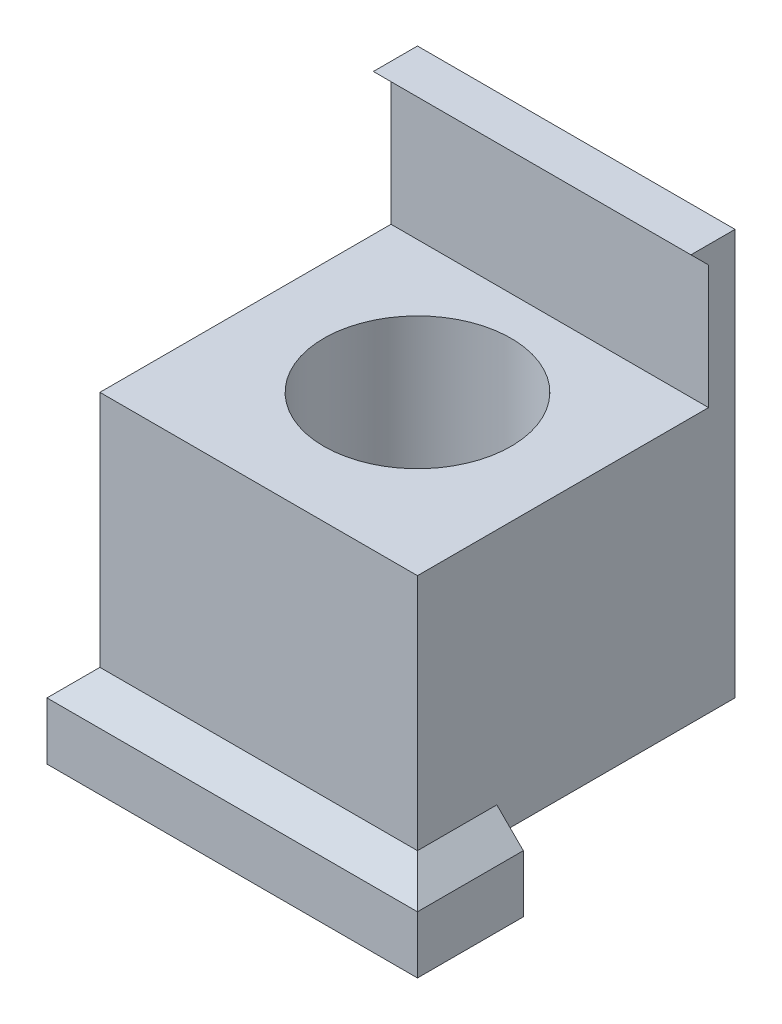
ISO-10303-21;
HEADER;
FILE_DESCRIPTION(('STEP AP214'),'2;1');
FILE_NAME('part.step','',(''),(''),'','','');
FILE_SCHEMA(('AUTOMOTIVE_DESIGN { 1 0 10303 214 1 1 1 1 }'));
ENDSEC;
DATA;
#1=APPLICATION_CONTEXT('core data for automotive mechanical design processes');
#2=APPLICATION_PROTOCOL_DEFINITION('international standard','automotive_design',2000,#1);
#3=PRODUCT_CONTEXT('',#1,'mechanical');
#4=PRODUCT('Part','Part','',(#3));
#5=PRODUCT_RELATED_PRODUCT_CATEGORY('part','',(#4));
#6=PRODUCT_DEFINITION_FORMATION('','',#4);
#7=PRODUCT_DEFINITION_CONTEXT('part definition',#1,'design');
#8=PRODUCT_DEFINITION('design','',#6,#7);
#9=PRODUCT_DEFINITION_SHAPE('','',#8);
#10=(LENGTH_UNIT() NAMED_UNIT(*) SI_UNIT(.MILLI.,.METRE.));
#11=(NAMED_UNIT(*) PLANE_ANGLE_UNIT() SI_UNIT($,.RADIAN.));
#12=(NAMED_UNIT(*) SI_UNIT($,.STERADIAN.) SOLID_ANGLE_UNIT());
#13=UNCERTAINTY_MEASURE_WITH_UNIT(LENGTH_MEASURE(1.E-05),#10,'distance_accuracy_value','');
#14=(GEOMETRIC_REPRESENTATION_CONTEXT(3) GLOBAL_UNCERTAINTY_ASSIGNED_CONTEXT((#13)) GLOBAL_UNIT_ASSIGNED_CONTEXT((#10,
#11,#12)) REPRESENTATION_CONTEXT('',''));
#15=CARTESIAN_POINT('',(0.,0.,0.));
#16=DIRECTION('',(0.,0.,1.));
#17=DIRECTION('',(1.,0.,0.));
#18=AXIS2_PLACEMENT_3D('',#15,#16,#17);
#19=CARTESIAN_POINT('',(0.,0.,3.96777206283517));
#20=DIRECTION('',(0.,0.,-1.));
#21=DIRECTION('',(-1.,0.,0.));
#22=AXIS2_PLACEMENT_3D('',#19,#20,#21);
#23=PLANE('',#22);
#24=DIRECTION('',(1.,0.,0.));
#25=VECTOR('',#24,1.);
#26=CARTESIAN_POINT('',(-14.7575768232034,-1.625,3.96777206283517));
#27=LINE('',#26,#25);
#28=CARTESIAN_POINT('',(-13.2575768232034,-1.625,3.96777206283517));
#29=VERTEX_POINT('',#28);
#30=CARTESIAN_POINT('',(1.74242317679656,-1.625,3.96777206283517));
#31=VERTEX_POINT('',#30);
#32=EDGE_CURVE('E53',#29,#31,#27,.T.);
#33=ORIENTED_EDGE('',*,*,#32,.T.);
#34=DIRECTION('',(0.,1.,0.));
#35=VECTOR('',#34,1.);
#36=CARTESIAN_POINT('',(1.74242317679656,-3.25,3.96777206283517));
#37=LINE('',#36,#35);
#38=CARTESIAN_POINT('',(1.74242317679656,-3.25,3.96777206283517));
#39=VERTEX_POINT('',#38);
#40=EDGE_CURVE('E48',#39,#31,#37,.T.);
#41=ORIENTED_EDGE('',*,*,#40,.F.);
#42=DIRECTION('',(-1.,0.,0.));
#43=VECTOR('',#42,1.);
#44=CARTESIAN_POINT('',(-14.7575768232034,-3.25,3.96777206283517));
#45=LINE('',#44,#43);
#46=CARTESIAN_POINT('',(-13.2575768232034,-3.25,3.96777206283517));
#47=VERTEX_POINT('',#46);
#48=EDGE_CURVE('E223',#39,#47,#45,.T.);
#49=ORIENTED_EDGE('',*,*,#48,.T.);
#50=DIRECTION('',(0.,-1.,0.));
#51=VECTOR('',#50,1.);
#52=CARTESIAN_POINT('',(-13.2575768232034,0.,3.96777206283517));
#53=LINE('',#52,#51);
#54=EDGE_CURVE('E199',#29,#47,#53,.T.);
#55=ORIENTED_EDGE('',*,*,#54,.F.);
#56=EDGE_LOOP('',(#33,#41,#49,#55));
#57=FACE_BOUND('',#56,.T.);
#58=ADVANCED_FACE('F33',(#57),#23,.T.);
#59=CARTESIAN_POINT('',(3.24242317679656,-3.25,0.967772062835173));
#60=DIRECTION('',(1.,0.,0.));
#61=DIRECTION('',(0.,0.,-1.));
#62=AXIS2_PLACEMENT_3D('',#59,#60,#61);
#63=PLANE('',#62);
#64=DIRECTION('',(0.,1.,0.));
#65=VECTOR('',#64,1.);
#66=CARTESIAN_POINT('',(3.24242317679656,-3.25,0.967772062835173));
#67=LINE('',#66,#65);
#68=CARTESIAN_POINT('',(3.24242317679656,-1.625,0.967772062835173));
#69=VERTEX_POINT('',#68);
#70=CARTESIAN_POINT('',(3.24242317679656,0.,0.967772062835173));
#71=VERTEX_POINT('',#70);
#72=EDGE_CURVE('E348',#69,#71,#67,.T.);
#73=ORIENTED_EDGE('',*,*,#72,.F.);
#74=DIRECTION('',(0.,0.,1.));
#75=VECTOR('',#74,1.);
#76=CARTESIAN_POINT('',(3.24242317679656,-1.625,3.96777206283517));
#77=LINE('',#76,#75);
#78=CARTESIAN_POINT('',(3.24242317679656,-1.625,5.46777206283517));
#79=VERTEX_POINT('',#78);
#80=EDGE_CURVE('E262',#69,#79,#77,.T.);
#81=ORIENTED_EDGE('',*,*,#80,.T.);
#82=DIRECTION('',(0.,1.,0.));
#83=VECTOR('',#82,1.);
#84=CARTESIAN_POINT('',(3.24242317679656,-3.25,5.46777206283517));
#85=LINE('',#84,#83);
#86=CARTESIAN_POINT('',(3.24242317679656,0.,5.46777206283517));
#87=VERTEX_POINT('',#86);
#88=EDGE_CURVE('E269',#79,#87,#85,.T.);
#89=ORIENTED_EDGE('',*,*,#88,.T.);
#90=DIRECTION('',(0.,0.,-1.));
#91=VECTOR('',#90,1.);
#92=CARTESIAN_POINT('',(3.24242317679656,0.,0.967772062835173));
#93=LINE('',#92,#91);
#94=EDGE_CURVE('E354',#87,#71,#93,.T.);
#95=ORIENTED_EDGE('',*,*,#94,.T.);
#96=EDGE_LOOP('',(#73,#81,#89,#95));
#97=FACE_BOUND('',#96,.T.);
#98=ADVANCED_FACE('F418',(#97),#63,.F.);
#99=CARTESIAN_POINT('',(0.,0.,0.));
#100=DIRECTION('',(0.,1.,0.));
#101=DIRECTION('',(0.,0.,1.));
#102=AXIS2_PLACEMENT_3D('',#99,#100,#101);
#103=PLANE('',#102);
#104=ORIENTED_EDGE('',*,*,#94,.F.);
#105=DIRECTION('',(1.,0.,0.));
#106=VECTOR('',#105,1.);
#107=CARTESIAN_POINT('',(3.24242317679656,0.,5.46777206283517));
#108=LINE('',#107,#106);
#109=CARTESIAN_POINT('',(-14.7575768232034,0.,5.46777206283517));
#110=VERTEX_POINT('',#109);
#111=EDGE_CURVE('E266',#110,#87,#108,.T.);
#112=ORIENTED_EDGE('',*,*,#111,.F.);
#113=DIRECTION('',(0.,0.,1.));
#114=VECTOR('',#113,1.);
#115=CARTESIAN_POINT('',(-14.7575768232034,0.,6.96777206283517));
#116=LINE('',#115,#114);
#117=CARTESIAN_POINT('',(-14.7575768232034,0.,-12.5322279371648));
#118=VERTEX_POINT('',#117);
#119=EDGE_CURVE('E246',#118,#110,#116,.T.);
#120=ORIENTED_EDGE('',*,*,#119,.F.);
#121=DIRECTION('',(-1.,0.,0.));
#122=VECTOR('',#121,1.);
#123=CARTESIAN_POINT('',(-14.7575768232034,0.,-12.5322279371648));
#124=LINE('',#123,#122);
#125=CARTESIAN_POINT('',(3.24242317679655,0.,-12.5322279371648));
#126=VERTEX_POINT('',#125);
#127=EDGE_CURVE('E307',#126,#118,#124,.T.);
#128=ORIENTED_EDGE('',*,*,#127,.F.);
#129=DIRECTION('',(0.,0.,-1.));
#130=VECTOR('',#129,1.);
#131=CARTESIAN_POINT('',(3.24242317679655,0.,-12.5322279371648));
#132=LINE('',#131,#130);
#133=EDGE_CURVE('E302',#71,#126,#132,.T.);
#134=ORIENTED_EDGE('',*,*,#133,.F.);
#135=EDGE_LOOP('',(#104,#112,#120,#128,#134));
#136=FACE_BOUND('',#135,.T.);
#137=ADVANCED_FACE('F333',(#136),#103,.F.);
#138=CARTESIAN_POINT('',(3.24242317679655,15.,-12.5322279371648));
#139=DIRECTION('',(-1.,0.,0.));
#140=DIRECTION('',(0.,0.,1.));
#141=AXIS2_PLACEMENT_3D('',#138,#139,#140);
#142=PLANE('',#141);
#143=ORIENTED_EDGE('',*,*,#133,.T.);
#144=DIRECTION('',(0.,-1.,0.));
#145=VECTOR('',#144,1.);
#146=CARTESIAN_POINT('',(3.24242317679655,15.,-12.5322279371648));
#147=LINE('',#146,#145);
#148=CARTESIAN_POINT('',(3.24242317679655,23.,-12.5322279371648));
#149=VERTEX_POINT('',#148);
#150=EDGE_CURVE('E206',#149,#126,#147,.T.);
#151=ORIENTED_EDGE('',*,*,#150,.F.);
#152=DIRECTION('',(0.,0.,-1.));
#153=VECTOR('',#152,1.);
#154=CARTESIAN_POINT('',(3.24242317679655,23.,-12.5322279371648));
#155=LINE('',#154,#153);
#156=CARTESIAN_POINT('',(3.24242317679656,23.,-10.0322279371648));
#157=VERTEX_POINT('',#156);
#158=EDGE_CURVE('E286',#157,#149,#155,.T.);
#159=ORIENTED_EDGE('',*,*,#158,.F.);
#160=DIRECTION('',(0.,-0.706137307692291,-0.708074927310014));
#161=VECTOR('',#160,1.);
#162=CARTESIAN_POINT('',(3.24242317679655,22.0027364612741,-11.0322279371648));
#163=LINE('',#162,#161);
#164=CARTESIAN_POINT('',(3.24242317679655,22.0027364612741,-11.0322279371648));
#165=VERTEX_POINT('',#164);
#166=EDGE_CURVE('E274',#157,#165,#163,.T.);
#167=ORIENTED_EDGE('',*,*,#166,.T.);
#168=DIRECTION('',(0.,-1.,0.));
#169=VECTOR('',#168,1.);
#170=CARTESIAN_POINT('',(3.24242317679656,23.,-11.0322279371648));
#171=LINE('',#170,#169);
#172=CARTESIAN_POINT('',(3.24242317679656,15.,-11.0322279371648));
#173=VERTEX_POINT('',#172);
#174=EDGE_CURVE('E292',#165,#173,#171,.T.);
#175=ORIENTED_EDGE('',*,*,#174,.T.);
#176=DIRECTION('',(0.,0.,-1.));
#177=VECTOR('',#176,1.);
#178=CARTESIAN_POINT('',(3.24242317679655,15.,-12.5322279371648));
#179=LINE('',#178,#177);
#180=CARTESIAN_POINT('',(3.24242317679656,15.,5.46777206283517));
#181=VERTEX_POINT('',#180);
#182=EDGE_CURVE('E309',#181,#173,#179,.T.);
#183=ORIENTED_EDGE('',*,*,#182,.F.);
#184=DIRECTION('',(0.,-1.,0.));
#185=VECTOR('',#184,1.);
#186=CARTESIAN_POINT('',(3.24242317679656,15.,5.46777206283517));
#187=LINE('',#186,#185);
#188=CARTESIAN_POINT('',(3.24242317679655,1.5,5.46777206283517));
#189=VERTEX_POINT('',#188);
#190=EDGE_CURVE('E204',#181,#189,#187,.T.);
#191=ORIENTED_EDGE('',*,*,#190,.T.);
#192=DIRECTION('',(0.,0.,1.));
#193=VECTOR('',#192,1.);
#194=CARTESIAN_POINT('',(3.24242317679656,1.5,0.967772062835173));
#195=LINE('',#194,#193);
#196=CARTESIAN_POINT('',(3.24242317679655,1.5,0.967772062835173));
#197=VERTEX_POINT('',#196);
#198=EDGE_CURVE('E344',#197,#189,#195,.T.);
#199=ORIENTED_EDGE('',*,*,#198,.F.);
#200=DIRECTION('',(0.,1.,0.));
#201=VECTOR('',#200,1.);
#202=CARTESIAN_POINT('',(3.24242317679656,1.5,0.967772062835173));
#203=LINE('',#202,#201);
#204=EDGE_CURVE('E329',#71,#197,#203,.T.);
#205=ORIENTED_EDGE('',*,*,#204,.F.);
#206=EDGE_LOOP('',(#143,#151,#159,#167,#175,#183,#191,#199,#205));
#207=FACE_BOUND('',#206,.T.);
#208=ADVANCED_FACE('F326',(#207),#142,.F.);
#209=CARTESIAN_POINT('',(3.24242317679656,-3.25,5.46777206283517));
#210=DIRECTION('',(0.,0.,1.));
#211=DIRECTION('',(1.,0.,0.));
#212=AXIS2_PLACEMENT_3D('',#209,#210,#211);
#213=PLANE('',#212);
#214=DIRECTION('',(1.,0.,0.));
#215=VECTOR('',#214,1.);
#216=CARTESIAN_POINT('',(3.24242317679656,-1.49347054544951,5.46777206283517));
#217=LINE('',#216,#215);
#218=CARTESIAN_POINT('',(-14.7575768232034,-1.49347054544951,5.46777206283517));
#219=VERTEX_POINT('',#218);
#220=CARTESIAN_POINT('',(-13.2575768232034,-1.49347054544951,5.46777206283517));
#221=VERTEX_POINT('',#220);
#222=EDGE_CURVE('E231',#219,#221,#217,.T.);
#223=ORIENTED_EDGE('',*,*,#222,.F.);
#224=DIRECTION('',(0.,1.,0.));
#225=VECTOR('',#224,1.);
#226=CARTESIAN_POINT('',(-14.7575768232034,-3.25,5.46777206283517));
#227=LINE('',#226,#225);
#228=EDGE_CURVE('E190',#219,#110,#227,.T.);
#229=ORIENTED_EDGE('',*,*,#228,.T.);
#230=ORIENTED_EDGE('',*,*,#111,.T.);
#231=ORIENTED_EDGE('',*,*,#88,.F.);
#232=DIRECTION('',(1.,0.,0.));
#233=VECTOR('',#232,1.);
#234=CARTESIAN_POINT('',(-14.7575768232034,-1.625,5.46777206283517));
#235=LINE('',#234,#233);
#236=CARTESIAN_POINT('',(-13.2575768232034,-1.625,5.46777206283517));
#237=VERTEX_POINT('',#236);
#238=EDGE_CURVE('E258',#237,#79,#235,.T.);
#239=ORIENTED_EDGE('',*,*,#238,.F.);
#240=DIRECTION('',(0.,1.,0.));
#241=VECTOR('',#240,1.);
#242=CARTESIAN_POINT('',(-13.2575768232034,-3.25,5.46777206283517));
#243=LINE('',#242,#241);
#244=EDGE_CURVE('E243',#237,#221,#243,.T.);
#245=ORIENTED_EDGE('',*,*,#244,.T.);
#246=EDGE_LOOP('',(#223,#229,#230,#231,#239,#245));
#247=FACE_BOUND('',#246,.T.);
#248=ADVANCED_FACE('F435',(#247),#213,.F.);
#249=CARTESIAN_POINT('',(-14.7575768232034,-3.25,6.96777206283517));
#250=DIRECTION('',(-1.,0.,0.));
#251=DIRECTION('',(0.,0.,1.));
#252=AXIS2_PLACEMENT_3D('',#249,#250,#251);
#253=PLANE('',#252);
#254=DIRECTION('',(0.,0.,1.));
#255=VECTOR('',#254,1.);
#256=CARTESIAN_POINT('',(-14.7575768232034,-1.49347054544951,-12.5322279371648));
#257=LINE('',#256,#255);
#258=CARTESIAN_POINT('',(-14.7575768232034,-1.49347054544951,-12.5322279371648));
#259=VERTEX_POINT('',#258);
#260=EDGE_CURVE('E238',#259,#219,#257,.T.);
#261=ORIENTED_EDGE('',*,*,#260,.F.);
#262=DIRECTION('',(0.,1.,0.));
#263=VECTOR('',#262,1.);
#264=CARTESIAN_POINT('',(-14.7575768232034,-3.25,-12.5322279371648));
#265=LINE('',#264,#263);
#266=EDGE_CURVE('E250',#259,#118,#265,.T.);
#267=ORIENTED_EDGE('',*,*,#266,.T.);
#268=ORIENTED_EDGE('',*,*,#119,.T.);
#269=ORIENTED_EDGE('',*,*,#228,.F.);
#270=EDGE_LOOP('',(#261,#267,#268,#269));
#271=FACE_BOUND('',#270,.T.);
#272=ADVANCED_FACE('F338',(#271),#253,.F.);
#273=CARTESIAN_POINT('',(-14.7575768232034,15.,-12.5322279371648));
#274=DIRECTION('',(1.,0.,0.));
#275=DIRECTION('',(0.,0.,-1.));
#276=AXIS2_PLACEMENT_3D('',#273,#274,#275);
#277=PLANE('',#276);
#278=DIRECTION('',(0.,0.,-1.));
#279=VECTOR('',#278,1.);
#280=CARTESIAN_POINT('',(-14.7575768232034,1.5,6.96777206283517));
#281=LINE('',#280,#279);
#282=CARTESIAN_POINT('',(-14.7575768232034,1.5,5.46777206283517));
#283=VERTEX_POINT('',#282);
#284=CARTESIAN_POINT('',(-14.7575768232034,1.5,-12.5322279371648));
#285=VERTEX_POINT('',#284);
#286=EDGE_CURVE('E173',#283,#285,#281,.T.);
#287=ORIENTED_EDGE('',*,*,#286,.F.);
#288=DIRECTION('',(0.,-1.,0.));
#289=VECTOR('',#288,1.);
#290=CARTESIAN_POINT('',(-14.7575768232034,15.,5.46777206283517));
#291=LINE('',#290,#289);
#292=CARTESIAN_POINT('',(-14.7575768232034,15.,5.46777206283517));
#293=VERTEX_POINT('',#292);
#294=EDGE_CURVE('E196',#293,#283,#291,.T.);
#295=ORIENTED_EDGE('',*,*,#294,.F.);
#296=DIRECTION('',(0.,0.,1.));
#297=VECTOR('',#296,1.);
#298=CARTESIAN_POINT('',(-14.7575768232034,15.,-12.5322279371648));
#299=LINE('',#298,#297);
#300=CARTESIAN_POINT('',(-14.7575768232034,15.,-11.0322279371648));
#301=VERTEX_POINT('',#300);
#302=EDGE_CURVE('E305',#301,#293,#299,.T.);
#303=ORIENTED_EDGE('',*,*,#302,.F.);
#304=DIRECTION('',(0.,-1.,0.));
#305=VECTOR('',#304,1.);
#306=CARTESIAN_POINT('',(-14.7575768232034,23.,-11.0322279371648));
#307=LINE('',#306,#305);
#308=CARTESIAN_POINT('',(-14.7575768232034,22.0027364612741,-11.0322279371648));
#309=VERTEX_POINT('',#308);
#310=EDGE_CURVE('E296',#309,#301,#307,.T.);
#311=ORIENTED_EDGE('',*,*,#310,.F.);
#312=DIRECTION('',(0.,-0.706137307692291,-0.708074927310014));
#313=VECTOR('',#312,1.);
#314=CARTESIAN_POINT('',(-14.7575768232034,22.0027364612741,-11.0322279371648));
#315=LINE('',#314,#313);
#316=CARTESIAN_POINT('',(-14.7575768232034,23.,-10.0322279371648));
#317=VERTEX_POINT('',#316);
#318=EDGE_CURVE('E189',#317,#309,#315,.T.);
#319=ORIENTED_EDGE('',*,*,#318,.F.);
#320=DIRECTION('',(0.,0.,1.));
#321=VECTOR('',#320,1.);
#322=CARTESIAN_POINT('',(-14.7575768232034,23.,-12.5322279371648));
#323=LINE('',#322,#321);
#324=CARTESIAN_POINT('',(-14.7575768232034,23.,-12.5322279371648));
#325=VERTEX_POINT('',#324);
#326=EDGE_CURVE('E283',#325,#317,#323,.T.);
#327=ORIENTED_EDGE('',*,*,#326,.F.);
#328=DIRECTION('',(0.,-1.,0.));
#329=VECTOR('',#328,1.);
#330=CARTESIAN_POINT('',(-14.7575768232034,15.,-12.5322279371648));
#331=LINE('',#330,#329);
#332=EDGE_CURVE('E198',#325,#285,#331,.T.);
#333=ORIENTED_EDGE('',*,*,#332,.T.);
#334=EDGE_LOOP('',(#287,#295,#303,#311,#319,#327,#333));
#335=FACE_BOUND('',#334,.T.);
#336=ADVANCED_FACE('F35',(#335),#277,.F.);
#337=CARTESIAN_POINT('',(-14.7575768232034,15.,5.46777206283517));
#338=DIRECTION('',(0.,0.,-1.));
#339=DIRECTION('',(-1.,0.,0.));
#340=AXIS2_PLACEMENT_3D('',#337,#338,#339);
#341=PLANE('',#340);
#342=DIRECTION('',(-1.,0.,0.));
#343=VECTOR('',#342,1.);
#344=CARTESIAN_POINT('',(3.24242317679656,1.5,5.46777206283517));
#345=LINE('',#344,#343);
#346=EDGE_CURVE('E181',#189,#283,#345,.T.);
#347=ORIENTED_EDGE('',*,*,#346,.F.);
#348=ORIENTED_EDGE('',*,*,#190,.F.);
#349=DIRECTION('',(1.,0.,0.));
#350=VECTOR('',#349,1.);
#351=CARTESIAN_POINT('',(-14.7575768232034,15.,5.46777206283517));
#352=LINE('',#351,#350);
#353=EDGE_CURVE('E203',#293,#181,#352,.T.);
#354=ORIENTED_EDGE('',*,*,#353,.F.);
#355=ORIENTED_EDGE('',*,*,#294,.T.);
#356=EDGE_LOOP('',(#347,#348,#354,#355));
#357=FACE_BOUND('',#356,.T.);
#358=ADVANCED_FACE('F202',(#357),#341,.F.);
#359=CARTESIAN_POINT('',(-14.7575768232034,23.,-11.0322279371648));
#360=DIRECTION('',(0.,0.,-1.));
#361=DIRECTION('',(-1.,0.,0.));
#362=AXIS2_PLACEMENT_3D('',#359,#360,#361);
#363=PLANE('',#362);
#364=DIRECTION('',(1.,0.,0.));
#365=VECTOR('',#364,1.);
#366=CARTESIAN_POINT('',(-14.7575768232034,22.0027364612741,-11.0322279371648));
#367=LINE('',#366,#365);
#368=EDGE_CURVE('E277',#309,#165,#367,.T.);
#369=ORIENTED_EDGE('',*,*,#368,.F.);
#370=ORIENTED_EDGE('',*,*,#310,.T.);
#371=DIRECTION('',(1.,0.,0.));
#372=VECTOR('',#371,1.);
#373=CARTESIAN_POINT('',(-14.7575768232034,15.,-11.0322279371648));
#374=LINE('',#373,#372);
#375=EDGE_CURVE('E281',#301,#173,#374,.T.);
#376=ORIENTED_EDGE('',*,*,#375,.T.);
#377=ORIENTED_EDGE('',*,*,#174,.F.);
#378=EDGE_LOOP('',(#369,#370,#376,#377));
#379=FACE_BOUND('',#378,.T.);
#380=ADVANCED_FACE('F400',(#379),#363,.F.);
#381=CARTESIAN_POINT('',(-14.7575768232034,15.,-12.5322279371648));
#382=DIRECTION('',(0.,0.,1.));
#383=DIRECTION('',(1.,0.,0.));
#384=AXIS2_PLACEMENT_3D('',#381,#382,#383);
#385=PLANE('',#384);
#386=DIRECTION('',(0.,-1.,0.));
#387=VECTOR('',#386,1.);
#388=CARTESIAN_POINT('',(-16.2575768232034,1.5,-12.5322279371648));
#389=LINE('',#388,#387);
#390=CARTESIAN_POINT('',(-16.2575768232034,0.,-12.5322279371648));
#391=VERTEX_POINT('',#390);
#392=CARTESIAN_POINT('',(-16.2575768232034,-3.25,-12.5322279371648));
#393=VERTEX_POINT('',#392);
#394=EDGE_CURVE('E257',#391,#393,#389,.T.);
#395=ORIENTED_EDGE('',*,*,#394,.F.);
#396=DIRECTION('',(-0.707106781186548,-0.707106781186547,0.));
#397=VECTOR('',#396,1.);
#398=CARTESIAN_POINT('',(-16.2575768232034,0.,-12.5322279371648));
#399=LINE('',#398,#397);
#400=EDGE_CURVE('E378',#285,#391,#399,.T.);
#401=ORIENTED_EDGE('',*,*,#400,.F.);
#402=ORIENTED_EDGE('',*,*,#332,.F.);
#403=DIRECTION('',(-1.,0.,0.));
#404=VECTOR('',#403,1.);
#405=CARTESIAN_POINT('',(-14.7575768232034,23.,-12.5322279371648));
#406=LINE('',#405,#404);
#407=EDGE_CURVE('E289',#149,#325,#406,.T.);
#408=ORIENTED_EDGE('',*,*,#407,.F.);
#409=ORIENTED_EDGE('',*,*,#150,.T.);
#410=ORIENTED_EDGE('',*,*,#127,.T.);
#411=ORIENTED_EDGE('',*,*,#266,.F.);
#412=DIRECTION('',(-1.,0.,0.));
#413=VECTOR('',#412,1.);
#414=CARTESIAN_POINT('',(-13.2575768232034,-1.49347054544951,-12.5322279371648));
#415=LINE('',#414,#413);
#416=CARTESIAN_POINT('',(-13.2575768232034,-1.49347054544951,-12.5322279371648));
#417=VERTEX_POINT('',#416);
#418=EDGE_CURVE('E228',#417,#259,#415,.T.);
#419=ORIENTED_EDGE('',*,*,#418,.F.);
#420=DIRECTION('',(0.,1.,0.));
#421=VECTOR('',#420,1.);
#422=CARTESIAN_POINT('',(-13.2575768232034,-3.25,-12.5322279371648));
#423=LINE('',#422,#421);
#424=CARTESIAN_POINT('',(-13.2575768232034,-3.25,-12.5322279371648));
#425=VERTEX_POINT('',#424);
#426=EDGE_CURVE('E234',#425,#417,#423,.T.);
#427=ORIENTED_EDGE('',*,*,#426,.F.);
#428=DIRECTION('',(1.,0.,0.));
#429=VECTOR('',#428,1.);
#430=CARTESIAN_POINT('',(-16.2575768232034,-3.25,-12.5322279371648));
#431=LINE('',#430,#429);
#432=EDGE_CURVE('E227',#393,#425,#431,.T.);
#433=ORIENTED_EDGE('',*,*,#432,.F.);
#434=EDGE_LOOP('',(#395,#401,#402,#408,#409,#410,#411,#419,#427,#433));
#435=FACE_BOUND('',#434,.T.);
#436=ADVANCED_FACE('F319',(#435),#385,.F.);
#437=CARTESIAN_POINT('',(0.,15.,0.));
#438=DIRECTION('',(0.,1.,0.));
#439=DIRECTION('',(0.,0.,1.));
#440=AXIS2_PLACEMENT_3D('',#437,#438,#439);
#441=PLANE('',#440);
#442=ORIENTED_EDGE('',*,*,#375,.F.);
#443=ORIENTED_EDGE('',*,*,#302,.T.);
#444=ORIENTED_EDGE('',*,*,#353,.T.);
#445=ORIENTED_EDGE('',*,*,#182,.T.);
#446=EDGE_LOOP('',(#442,#443,#444,#445));
#447=FACE_BOUND('',#446,.T.);
#448=CARTESIAN_POINT('',(-5.75757682320345,15.,-3.53222793716483));
#449=DIRECTION('',(0.,1.,0.));
#450=DIRECTION('',(0.,0.,1.));
#451=AXIS2_PLACEMENT_3D('',#448,#449,#450);
#452=CIRCLE('',#451,5.30669129500518);
#453=CARTESIAN_POINT('',(-5.75757682320345,15.,1.77446335784035));
#454=VERTEX_POINT('',#453);
#455=EDGE_CURVE('E298',#454,#454,#452,.T.);
#456=ORIENTED_EDGE('',*,*,#455,.F.);
#457=EDGE_LOOP('',(#456));
#458=FACE_BOUND('',#457,.T.);
#459=ADVANCED_FACE('F396',(#447,#458),#441,.T.);
#460=CARTESIAN_POINT('',(-5.75757682320345,3.5,-3.53222793716483));
#461=DIRECTION('',(0.,1.,0.));
#462=DIRECTION('',(0.,0.,1.));
#463=AXIS2_PLACEMENT_3D('',#460,#461,#462);
#464=CYLINDRICAL_SURFACE('',#463,5.30669129500518);
#465=CARTESIAN_POINT('',(-5.75757682320345,3.5,-3.53222793716483));
#466=DIRECTION('',(0.,1.,0.));
#467=DIRECTION('',(0.,0.,1.));
#468=AXIS2_PLACEMENT_3D('',#465,#466,#467);
#469=CIRCLE('',#468,5.30669129500518);
#470=CARTESIAN_POINT('',(-5.75757682320345,3.5,1.77446335784035));
#471=VERTEX_POINT('',#470);
#472=EDGE_CURVE('E299',#471,#471,#469,.T.);
#473=ORIENTED_EDGE('',*,*,#472,.F.);
#474=EDGE_LOOP('',(#473));
#475=FACE_BOUND('',#474,.T.);
#476=ORIENTED_EDGE('',*,*,#455,.T.);
#477=EDGE_LOOP('',(#476));
#478=FACE_BOUND('',#477,.T.);
#479=ADVANCED_FACE('F585',(#475,#478),#464,.F.);
#480=CARTESIAN_POINT('',(-5.75757682320345,3.5,-3.53222793716483));
#481=DIRECTION('',(0.,1.,0.));
#482=DIRECTION('',(0.,0.,1.));
#483=AXIS2_PLACEMENT_3D('',#480,#481,#482);
#484=PLANE('',#483);
#485=ORIENTED_EDGE('',*,*,#472,.T.);
#486=EDGE_LOOP('',(#485));
#487=FACE_BOUND('',#486,.T.);
#488=ADVANCED_FACE('F415',(#487),#484,.T.);
#489=CARTESIAN_POINT('',(0.,23.,0.));
#490=DIRECTION('',(0.,1.,0.));
#491=DIRECTION('',(0.,0.,1.));
#492=AXIS2_PLACEMENT_3D('',#489,#490,#491);
#493=PLANE('',#492);
#494=ORIENTED_EDGE('',*,*,#326,.T.);
#495=DIRECTION('',(-1.,0.,0.));
#496=VECTOR('',#495,1.);
#497=CARTESIAN_POINT('',(-14.7575768232034,23.,-10.0322279371648));
#498=LINE('',#497,#496);
#499=EDGE_CURVE('E279',#157,#317,#498,.T.);
#500=ORIENTED_EDGE('',*,*,#499,.F.);
#501=ORIENTED_EDGE('',*,*,#158,.T.);
#502=ORIENTED_EDGE('',*,*,#407,.T.);
#503=EDGE_LOOP('',(#494,#500,#501,#502));
#504=FACE_BOUND('',#503,.T.);
#505=ADVANCED_FACE('F406',(#504),#493,.T.);
#506=CARTESIAN_POINT('',(3.24242317679655,22.0027364612741,-11.0322279371648));
#507=DIRECTION('',(0.,0.708074927310014,-0.706137307692291));
#508=DIRECTION('',(0.,0.706137307692291,0.708074927310015));
#509=AXIS2_PLACEMENT_3D('',#506,#507,#508);
#510=PLANE('',#509);
#511=ORIENTED_EDGE('',*,*,#318,.T.);
#512=ORIENTED_EDGE('',*,*,#368,.T.);
#513=ORIENTED_EDGE('',*,*,#166,.F.);
#514=ORIENTED_EDGE('',*,*,#499,.T.);
#515=EDGE_LOOP('',(#511,#512,#513,#514));
#516=FACE_BOUND('',#515,.T.);
#517=ADVANCED_FACE('F407',(#516),#510,.F.);
#518=CARTESIAN_POINT('',(0.,0.,6.96777206283517));
#519=DIRECTION('',(0.,0.,1.));
#520=DIRECTION('',(1.,0.,0.));
#521=AXIS2_PLACEMENT_3D('',#518,#519,#520);
#522=PLANE('',#521);
#523=DIRECTION('',(1.,0.,0.));
#524=VECTOR('',#523,1.);
#525=CARTESIAN_POINT('',(-16.2575768232034,0.,6.96777206283518));
#526=LINE('',#525,#524);
#527=CARTESIAN_POINT('',(-16.2575768232034,0.,6.96777206283518));
#528=VERTEX_POINT('',#527);
#529=CARTESIAN_POINT('',(4.74242317679655,0.,6.96777206283517));
#530=VERTEX_POINT('',#529);
#531=EDGE_CURVE('E379',#528,#530,#526,.T.);
#532=ORIENTED_EDGE('',*,*,#531,.F.);
#533=DIRECTION('',(0.,1.,0.));
#534=VECTOR('',#533,1.);
#535=CARTESIAN_POINT('',(-16.2575768232034,1.5,6.96777206283517));
#536=LINE('',#535,#534);
#537=CARTESIAN_POINT('',(-16.2575768232034,-3.25,6.96777206283517));
#538=VERTEX_POINT('',#537);
#539=EDGE_CURVE('E254',#538,#528,#536,.T.);
#540=ORIENTED_EDGE('',*,*,#539,.F.);
#541=DIRECTION('',(-1.,0.,0.));
#542=VECTOR('',#541,1.);
#543=CARTESIAN_POINT('',(3.24242317679656,-3.25,6.96777206283517));
#544=LINE('',#543,#542);
#545=CARTESIAN_POINT('',(4.74242317679656,-3.25,6.96777206283517));
#546=VERTEX_POINT('',#545);
#547=EDGE_CURVE('E267',#546,#538,#544,.T.);
#548=ORIENTED_EDGE('',*,*,#547,.F.);
#549=DIRECTION('',(0.,-1.,0.));
#550=VECTOR('',#549,1.);
#551=CARTESIAN_POINT('',(4.74242317679656,1.5,6.96777206283517));
#552=LINE('',#551,#550);
#553=EDGE_CURVE('E239',#530,#546,#552,.T.);
#554=ORIENTED_EDGE('',*,*,#553,.F.);
#555=EDGE_LOOP('',(#532,#540,#548,#554));
#556=FACE_BOUND('',#555,.T.);
#557=ADVANCED_FACE('F386',(#556),#522,.T.);
#558=CARTESIAN_POINT('',(0.,-3.25,0.));
#559=DIRECTION('',(0.,1.,0.));
#560=DIRECTION('',(0.,0.,1.));
#561=AXIS2_PLACEMENT_3D('',#558,#559,#560);
#562=PLANE('',#561);
#563=ORIENTED_EDGE('',*,*,#48,.F.);
#564=DIRECTION('',(0.,0.,1.));
#565=VECTOR('',#564,1.);
#566=CARTESIAN_POINT('',(1.74242317679656,-3.25,0.967772062835173));
#567=LINE('',#566,#565);
#568=CARTESIAN_POINT('',(1.74242317679656,-3.25,0.967772062835173));
#569=VERTEX_POINT('',#568);
#570=EDGE_CURVE('E368',#569,#39,#567,.T.);
#571=ORIENTED_EDGE('',*,*,#570,.F.);
#572=DIRECTION('',(1.,0.,0.));
#573=VECTOR('',#572,1.);
#574=CARTESIAN_POINT('',(4.74242317679656,-3.25,0.967772062835173));
#575=LINE('',#574,#573);
#576=CARTESIAN_POINT('',(4.74242317679656,-3.25,0.967772062835173));
#577=VERTEX_POINT('',#576);
#578=EDGE_CURVE('E353',#569,#577,#575,.T.);
#579=ORIENTED_EDGE('',*,*,#578,.T.);
#580=DIRECTION('',(0.,0.,1.));
#581=VECTOR('',#580,1.);
#582=CARTESIAN_POINT('',(4.74242317679656,-3.25,0.967772062835173));
#583=LINE('',#582,#581);
#584=EDGE_CURVE('E357',#577,#546,#583,.T.);
#585=ORIENTED_EDGE('',*,*,#584,.T.);
#586=ORIENTED_EDGE('',*,*,#547,.T.);
#587=DIRECTION('',(0.,0.,-1.));
#588=VECTOR('',#587,1.);
#589=CARTESIAN_POINT('',(-16.2575768232034,-3.25,6.96777206283517));
#590=LINE('',#589,#588);
#591=EDGE_CURVE('E247',#538,#393,#590,.T.);
#592=ORIENTED_EDGE('',*,*,#591,.T.);
#593=ORIENTED_EDGE('',*,*,#432,.T.);
#594=DIRECTION('',(0.,0.,-1.));
#595=VECTOR('',#594,1.);
#596=CARTESIAN_POINT('',(-13.2575768232034,-3.25,-12.5322279371648));
#597=LINE('',#596,#595);
#598=EDGE_CURVE('E216',#47,#425,#597,.T.);
#599=ORIENTED_EDGE('',*,*,#598,.F.);
#600=EDGE_LOOP('',(#563,#571,#579,#585,#586,#592,#593,#599));
#601=FACE_BOUND('',#600,.T.);
#602=ADVANCED_FACE('F221',(#601),#562,.F.);
#603=CARTESIAN_POINT('',(-14.7575768232034,-1.625,3.96777206283517));
#604=DIRECTION('',(0.,-1.,0.));
#605=DIRECTION('',(1.,0.,0.));
#606=AXIS2_PLACEMENT_3D('',#603,#604,#605);
#607=PLANE('',#606);
#608=ORIENTED_EDGE('',*,*,#32,.F.);
#609=DIRECTION('',(0.,0.,1.));
#610=VECTOR('',#609,1.);
#611=CARTESIAN_POINT('',(-13.2575768232034,-1.625,3.96777206283517));
#612=LINE('',#611,#610);
#613=EDGE_CURVE('E219',#29,#237,#612,.T.);
#614=ORIENTED_EDGE('',*,*,#613,.T.);
#615=ORIENTED_EDGE('',*,*,#238,.T.);
#616=ORIENTED_EDGE('',*,*,#80,.F.);
#617=DIRECTION('',(1.,0.,0.));
#618=VECTOR('',#617,1.);
#619=CARTESIAN_POINT('',(1.74242317679656,-1.625,0.967772062835173));
#620=LINE('',#619,#618);
#621=CARTESIAN_POINT('',(1.74242317679656,-1.625,0.967772062835173));
#622=VERTEX_POINT('',#621);
#623=EDGE_CURVE('E358',#622,#69,#620,.T.);
#624=ORIENTED_EDGE('',*,*,#623,.F.);
#625=DIRECTION('',(0.,0.,-1.));
#626=VECTOR('',#625,1.);
#627=CARTESIAN_POINT('',(1.74242317679656,-1.625,0.967772062835173));
#628=LINE('',#627,#626);
#629=EDGE_CURVE('E365',#31,#622,#628,.T.);
#630=ORIENTED_EDGE('',*,*,#629,.F.);
#631=EDGE_LOOP('',(#608,#614,#615,#616,#624,#630));
#632=FACE_BOUND('',#631,.T.);
#633=ADVANCED_FACE('F429',(#632),#607,.F.);
#634=CARTESIAN_POINT('',(-16.2575768232034,0.,0.));
#635=DIRECTION('',(1.,0.,0.));
#636=DIRECTION('',(0.,0.,-1.));
#637=AXIS2_PLACEMENT_3D('',#634,#635,#636);
#638=PLANE('',#637);
#639=ORIENTED_EDGE('',*,*,#539,.T.);
#640=DIRECTION('',(0.,0.,-1.));
#641=VECTOR('',#640,1.);
#642=CARTESIAN_POINT('',(-16.2575768232034,0.,5.46777206283517));
#643=LINE('',#642,#641);
#644=EDGE_CURVE('E176',#528,#391,#643,.T.);
#645=ORIENTED_EDGE('',*,*,#644,.T.);
#646=ORIENTED_EDGE('',*,*,#394,.T.);
#647=ORIENTED_EDGE('',*,*,#591,.F.);
#648=EDGE_LOOP('',(#639,#645,#646,#647));
#649=FACE_BOUND('',#648,.T.);
#650=ADVANCED_FACE('F427',(#649),#638,.F.);
#651=CARTESIAN_POINT('',(-13.2575768232034,0.,0.));
#652=DIRECTION('',(1.,0.,0.));
#653=DIRECTION('',(0.,0.,-1.));
#654=AXIS2_PLACEMENT_3D('',#651,#652,#653);
#655=PLANE('',#654);
#656=ORIENTED_EDGE('',*,*,#244,.F.);
#657=ORIENTED_EDGE('',*,*,#613,.F.);
#658=ORIENTED_EDGE('',*,*,#54,.T.);
#659=ORIENTED_EDGE('',*,*,#598,.T.);
#660=ORIENTED_EDGE('',*,*,#426,.T.);
#661=DIRECTION('',(0.,0.,1.));
#662=VECTOR('',#661,1.);
#663=CARTESIAN_POINT('',(-13.2575768232034,-1.49347054544951,-12.5322279371648));
#664=LINE('',#663,#662);
#665=EDGE_CURVE('E229',#417,#221,#664,.T.);
#666=ORIENTED_EDGE('',*,*,#665,.T.);
#667=EDGE_LOOP('',(#656,#657,#658,#659,#660,#666));
#668=FACE_BOUND('',#667,.T.);
#669=ADVANCED_FACE('F214',(#668),#655,.T.);
#670=CARTESIAN_POINT('',(-13.2575768232034,-1.49347054544951,-12.5322279371648));
#671=DIRECTION('',(0.,-1.,0.));
#672=DIRECTION('',(0.,0.,-1.));
#673=AXIS2_PLACEMENT_3D('',#670,#671,#672);
#674=PLANE('',#673);
#675=ORIENTED_EDGE('',*,*,#260,.T.);
#676=ORIENTED_EDGE('',*,*,#222,.T.);
#677=ORIENTED_EDGE('',*,*,#665,.F.);
#678=ORIENTED_EDGE('',*,*,#418,.T.);
#679=EDGE_LOOP('',(#675,#676,#677,#678));
#680=FACE_BOUND('',#679,.T.);
#681=ADVANCED_FACE('F341',(#680),#674,.F.);
#682=CARTESIAN_POINT('',(4.74242317679656,1.5,0.967772062835173));
#683=DIRECTION('',(0.,0.,1.));
#684=DIRECTION('',(0.,-1.,0.));
#685=AXIS2_PLACEMENT_3D('',#682,#683,#684);
#686=PLANE('',#685);
#687=ORIENTED_EDGE('',*,*,#204,.T.);
#688=DIRECTION('',(0.707106781186548,-0.707106781186548,0.));
#689=VECTOR('',#688,1.);
#690=CARTESIAN_POINT('',(3.99242317679655,0.749999999999999,0.967772062835173));
#691=LINE('',#690,#689);
#692=CARTESIAN_POINT('',(4.74242317679655,0.,0.967772062835172));
#693=VERTEX_POINT('',#692);
#694=EDGE_CURVE('E373',#197,#693,#691,.T.);
#695=ORIENTED_EDGE('',*,*,#694,.T.);
#696=DIRECTION('',(0.,1.,0.));
#697=VECTOR('',#696,1.);
#698=CARTESIAN_POINT('',(4.74242317679656,1.5,0.967772062835173));
#699=LINE('',#698,#697);
#700=EDGE_CURVE('E346',#577,#693,#699,.T.);
#701=ORIENTED_EDGE('',*,*,#700,.F.);
#702=ORIENTED_EDGE('',*,*,#578,.F.);
#703=DIRECTION('',(0.,-1.,0.));
#704=VECTOR('',#703,1.);
#705=CARTESIAN_POINT('',(1.74242317679656,-3.25,0.967772062835173));
#706=LINE('',#705,#704);
#707=EDGE_CURVE('E370',#622,#569,#706,.T.);
#708=ORIENTED_EDGE('',*,*,#707,.F.);
#709=ORIENTED_EDGE('',*,*,#623,.T.);
#710=ORIENTED_EDGE('',*,*,#72,.T.);
#711=EDGE_LOOP('',(#687,#695,#701,#702,#708,#709,#710));
#712=FACE_BOUND('',#711,.T.);
#713=ADVANCED_FACE('F451',(#712),#686,.F.);
#714=CARTESIAN_POINT('',(4.74242317679656,0.,0.));
#715=DIRECTION('',(-1.,0.,0.));
#716=DIRECTION('',(0.,0.,1.));
#717=AXIS2_PLACEMENT_3D('',#714,#715,#716);
#718=PLANE('',#717);
#719=DIRECTION('',(0.,0.,-1.));
#720=VECTOR('',#719,1.);
#721=CARTESIAN_POINT('',(4.74242317679655,0.,5.46777206283517));
#722=LINE('',#721,#720);
#723=EDGE_CURVE('E376',#530,#693,#722,.T.);
#724=ORIENTED_EDGE('',*,*,#723,.F.);
#725=ORIENTED_EDGE('',*,*,#553,.T.);
#726=ORIENTED_EDGE('',*,*,#584,.F.);
#727=ORIENTED_EDGE('',*,*,#700,.T.);
#728=EDGE_LOOP('',(#724,#725,#726,#727));
#729=FACE_BOUND('',#728,.T.);
#730=ADVANCED_FACE('F389',(#729),#718,.F.);
#731=CARTESIAN_POINT('',(1.74242317679656,0.,0.));
#732=DIRECTION('',(1.,0.,0.));
#733=DIRECTION('',(0.,0.,-1.));
#734=AXIS2_PLACEMENT_3D('',#731,#732,#733);
#735=PLANE('',#734);
#736=ORIENTED_EDGE('',*,*,#707,.T.);
#737=ORIENTED_EDGE('',*,*,#570,.T.);
#738=ORIENTED_EDGE('',*,*,#40,.T.);
#739=ORIENTED_EDGE('',*,*,#629,.T.);
#740=EDGE_LOOP('',(#736,#737,#738,#739));
#741=FACE_BOUND('',#740,.T.);
#742=ADVANCED_FACE('F449',(#741),#735,.F.);
#743=CARTESIAN_POINT('',(4.74242317679655,0.,5.46777206283517));
#744=DIRECTION('',(-0.707106781186547,-0.707106781186547,0.));
#745=DIRECTION('',(0.707106781186548,-0.707106781186548,0.));
#746=AXIS2_PLACEMENT_3D('',#743,#744,#745);
#747=PLANE('',#746);
#748=ORIENTED_EDGE('',*,*,#198,.T.);
#749=DIRECTION('',(-0.577350269189628,0.577350269189625,-0.577350269189625));
#750=VECTOR('',#749,1.);
#751=CARTESIAN_POINT('',(-3.25757682320349,8.00000000000001,-1.03222793716483));
#752=LINE('',#751,#750);
#753=EDGE_CURVE('E41',#530,#189,#752,.T.);
#754=ORIENTED_EDGE('',*,*,#753,.F.);
#755=ORIENTED_EDGE('',*,*,#723,.T.);
#756=ORIENTED_EDGE('',*,*,#694,.F.);
#757=EDGE_LOOP('',(#748,#754,#755,#756));
#758=FACE_BOUND('',#757,.T.);
#759=ADVANCED_FACE('F391',(#758),#747,.F.);
#760=CARTESIAN_POINT('',(-16.2575768232034,0.,5.46777206283517));
#761=DIRECTION('',(0.707106781186547,-0.707106781186548,0.));
#762=DIRECTION('',(0.707106781186548,0.707106781186547,0.));
#763=AXIS2_PLACEMENT_3D('',#760,#761,#762);
#764=PLANE('',#763);
#765=ORIENTED_EDGE('',*,*,#400,.T.);
#766=ORIENTED_EDGE('',*,*,#644,.F.);
#767=DIRECTION('',(-0.577350269189626,-0.577350269189626,0.577350269189626));
#768=VECTOR('',#767,1.);
#769=CARTESIAN_POINT('',(-15.2575768232034,0.999999999999998,5.96777206283518));
#770=LINE('',#769,#768);
#771=EDGE_CURVE('E11',#283,#528,#770,.T.);
#772=ORIENTED_EDGE('',*,*,#771,.F.);
#773=ORIENTED_EDGE('',*,*,#286,.T.);
#774=EDGE_LOOP('',(#765,#766,#772,#773));
#775=FACE_BOUND('',#774,.T.);
#776=ADVANCED_FACE('F171',(#775),#764,.F.);
#777=CARTESIAN_POINT('',(-16.2575768232034,1.5,5.46777206283518));
#778=DIRECTION('',(0.,-0.707106781186548,-0.707106781186547));
#779=DIRECTION('',(0.,0.707106781186547,-0.707106781186548));
#780=AXIS2_PLACEMENT_3D('',#777,#778,#779);
#781=PLANE('',#780);
#782=ORIENTED_EDGE('',*,*,#346,.T.);
#783=ORIENTED_EDGE('',*,*,#771,.T.);
#784=ORIENTED_EDGE('',*,*,#531,.T.);
#785=ORIENTED_EDGE('',*,*,#753,.T.);
#786=EDGE_LOOP('',(#782,#783,#784,#785));
#787=FACE_BOUND('',#786,.T.);
#788=ADVANCED_FACE('F182',(#787),#781,.F.);
#789=CLOSED_SHELL('',(#58,#98,#137,#208,#248,#272,#336,#358,#380,#436,#459,#479,#488,#505,#517,
#557,#602,#633,#650,#669,#681,#713,#730,#742,#759,#776,#788));
#790=MANIFOLD_SOLID_BREP('B2',#789);
#791=ADVANCED_BREP_SHAPE_REPRESENTATION('',(#18,#790),#14);
#792=SHAPE_DEFINITION_REPRESENTATION(#9,#791);
ENDSEC;
END-ISO-10303-21;
